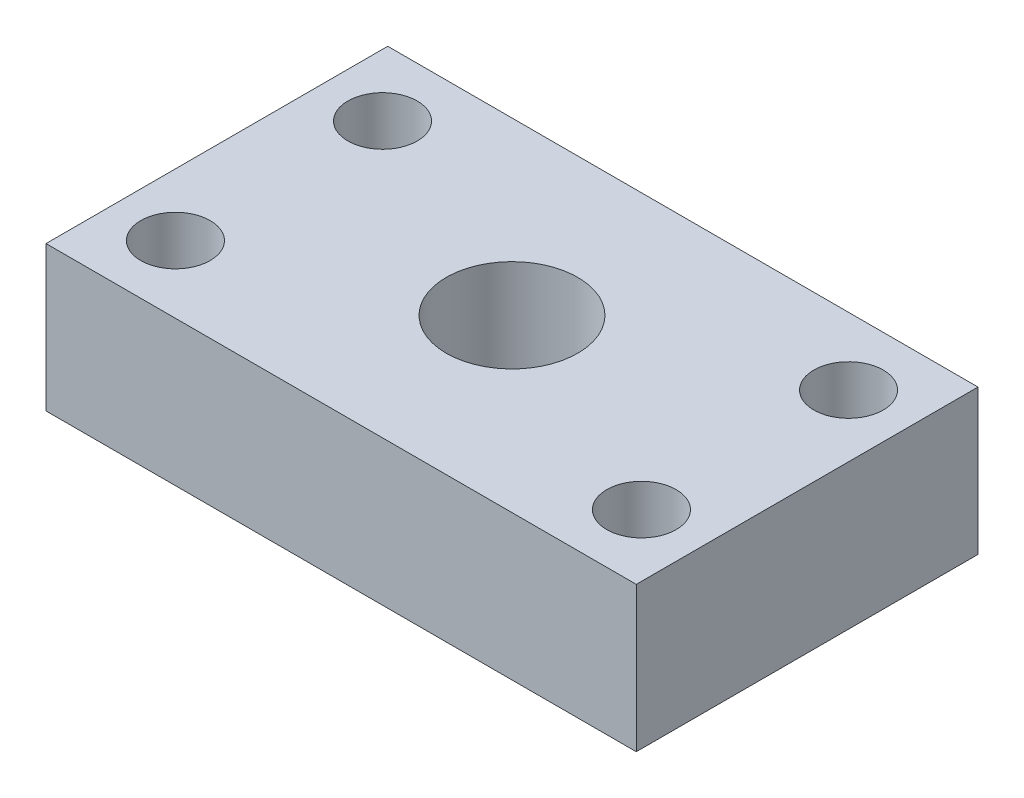
ISO-10303-21;
HEADER;
FILE_DESCRIPTION(('STEP AP214'),'2;1');
FILE_NAME('part.step','',(''),(''),'','','');
FILE_SCHEMA(('AUTOMOTIVE_DESIGN { 1 0 10303 214 1 1 1 1 }'));
ENDSEC;
DATA;
#1=APPLICATION_CONTEXT('core data for automotive mechanical design processes');
#2=APPLICATION_PROTOCOL_DEFINITION('international standard','automotive_design',2000,#1);
#3=PRODUCT_CONTEXT('',#1,'mechanical');
#4=PRODUCT('Part','Part','',(#3));
#5=PRODUCT_RELATED_PRODUCT_CATEGORY('part','',(#4));
#6=PRODUCT_DEFINITION_FORMATION('','',#4);
#7=PRODUCT_DEFINITION_CONTEXT('part definition',#1,'design');
#8=PRODUCT_DEFINITION('design','',#6,#7);
#9=PRODUCT_DEFINITION_SHAPE('','',#8);
#10=(LENGTH_UNIT() NAMED_UNIT(*) SI_UNIT(.MILLI.,.METRE.));
#11=(NAMED_UNIT(*) PLANE_ANGLE_UNIT() SI_UNIT($,.RADIAN.));
#12=(NAMED_UNIT(*) SI_UNIT($,.STERADIAN.) SOLID_ANGLE_UNIT());
#13=UNCERTAINTY_MEASURE_WITH_UNIT(LENGTH_MEASURE(1.E-05),#10,'distance_accuracy_value','');
#14=(GEOMETRIC_REPRESENTATION_CONTEXT(3) GLOBAL_UNCERTAINTY_ASSIGNED_CONTEXT((#13)) GLOBAL_UNIT_ASSIGNED_CONTEXT((#10,
#11,#12)) REPRESENTATION_CONTEXT('',''));
#15=CARTESIAN_POINT('',(0.,0.,0.));
#16=DIRECTION('',(0.,0.,1.));
#17=DIRECTION('',(1.,0.,0.));
#18=AXIS2_PLACEMENT_3D('',#15,#16,#17);
#19=CARTESIAN_POINT('',(0.,14.,0.));
#20=DIRECTION('',(1.,0.,0.));
#21=DIRECTION('',(0.,0.,-1.));
#22=AXIS2_PLACEMENT_3D('',#19,#20,#21);
#23=PLANE('',#22);
#24=DIRECTION('',(0.,0.,1.));
#25=VECTOR('',#24,1.);
#26=CARTESIAN_POINT('',(0.,0.,0.));
#27=LINE('',#26,#25);
#28=CARTESIAN_POINT('',(0.,0.,-33.));
#29=VERTEX_POINT('',#28);
#30=CARTESIAN_POINT('',(0.,0.,0.));
#31=VERTEX_POINT('',#30);
#32=EDGE_CURVE('E128',#29,#31,#27,.T.);
#33=ORIENTED_EDGE('',*,*,#32,.T.);
#34=DIRECTION('',(0.,-1.,0.));
#35=VECTOR('',#34,1.);
#36=CARTESIAN_POINT('',(0.,14.,0.));
#37=LINE('',#36,#35);
#38=CARTESIAN_POINT('',(0.,14.,0.));
#39=VERTEX_POINT('',#38);
#40=EDGE_CURVE('E11',#39,#31,#37,.T.);
#41=ORIENTED_EDGE('',*,*,#40,.F.);
#42=DIRECTION('',(0.,0.,1.));
#43=VECTOR('',#42,1.);
#44=CARTESIAN_POINT('',(0.,14.,0.));
#45=LINE('',#44,#43);
#46=CARTESIAN_POINT('',(0.,14.,-33.));
#47=VERTEX_POINT('',#46);
#48=EDGE_CURVE('E131',#47,#39,#45,.T.);
#49=ORIENTED_EDGE('',*,*,#48,.F.);
#50=DIRECTION('',(0.,-1.,0.));
#51=VECTOR('',#50,1.);
#52=CARTESIAN_POINT('',(0.,14.,-33.));
#53=LINE('',#52,#51);
#54=EDGE_CURVE('E137',#47,#29,#53,.T.);
#55=ORIENTED_EDGE('',*,*,#54,.T.);
#56=EDGE_LOOP('',(#33,#41,#49,#55));
#57=FACE_BOUND('',#56,.T.);
#58=ADVANCED_FACE('F38',(#57),#23,.F.);
#59=CARTESIAN_POINT('',(0.,14.,0.));
#60=DIRECTION('',(0.,0.,-1.));
#61=DIRECTION('',(-1.,0.,0.));
#62=AXIS2_PLACEMENT_3D('',#59,#60,#61);
#63=PLANE('',#62);
#64=DIRECTION('',(1.,0.,0.));
#65=VECTOR('',#64,1.);
#66=CARTESIAN_POINT('',(0.,0.,0.));
#67=LINE('',#66,#65);
#68=CARTESIAN_POINT('',(57.,0.,0.));
#69=VERTEX_POINT('',#68);
#70=EDGE_CURVE('E140',#31,#69,#67,.T.);
#71=ORIENTED_EDGE('',*,*,#70,.T.);
#72=DIRECTION('',(0.,-1.,0.));
#73=VECTOR('',#72,1.);
#74=CARTESIAN_POINT('',(57.,14.,0.));
#75=LINE('',#74,#73);
#76=CARTESIAN_POINT('',(57.,14.,0.));
#77=VERTEX_POINT('',#76);
#78=EDGE_CURVE('E46',#77,#69,#75,.T.);
#79=ORIENTED_EDGE('',*,*,#78,.F.);
#80=DIRECTION('',(1.,0.,0.));
#81=VECTOR('',#80,1.);
#82=CARTESIAN_POINT('',(0.,14.,0.));
#83=LINE('',#82,#81);
#84=EDGE_CURVE('E85',#39,#77,#83,.T.);
#85=ORIENTED_EDGE('',*,*,#84,.F.);
#86=ORIENTED_EDGE('',*,*,#40,.T.);
#87=EDGE_LOOP('',(#71,#79,#85,#86));
#88=FACE_BOUND('',#87,.T.);
#89=ADVANCED_FACE('F165',(#88),#63,.F.);
#90=CARTESIAN_POINT('',(57.,14.,0.));
#91=DIRECTION('',(-1.,0.,0.));
#92=DIRECTION('',(0.,0.,1.));
#93=AXIS2_PLACEMENT_3D('',#90,#91,#92);
#94=PLANE('',#93);
#95=DIRECTION('',(0.,0.,-1.));
#96=VECTOR('',#95,1.);
#97=CARTESIAN_POINT('',(57.,0.,0.));
#98=LINE('',#97,#96);
#99=CARTESIAN_POINT('',(57.,0.,-33.));
#100=VERTEX_POINT('',#99);
#101=EDGE_CURVE('E72',#69,#100,#98,.T.);
#102=ORIENTED_EDGE('',*,*,#101,.T.);
#103=DIRECTION('',(0.,-1.,0.));
#104=VECTOR('',#103,1.);
#105=CARTESIAN_POINT('',(57.,14.,-33.));
#106=LINE('',#105,#104);
#107=CARTESIAN_POINT('',(57.,14.,-33.));
#108=VERTEX_POINT('',#107);
#109=EDGE_CURVE('E145',#108,#100,#106,.T.);
#110=ORIENTED_EDGE('',*,*,#109,.F.);
#111=DIRECTION('',(0.,0.,-1.));
#112=VECTOR('',#111,1.);
#113=CARTESIAN_POINT('',(57.,14.,0.));
#114=LINE('',#113,#112);
#115=EDGE_CURVE('E134',#77,#108,#114,.T.);
#116=ORIENTED_EDGE('',*,*,#115,.F.);
#117=ORIENTED_EDGE('',*,*,#78,.T.);
#118=EDGE_LOOP('',(#102,#110,#116,#117));
#119=FACE_BOUND('',#118,.T.);
#120=ADVANCED_FACE('F147',(#119),#94,.F.);
#121=CARTESIAN_POINT('',(0.,14.,-33.));
#122=DIRECTION('',(0.,0.,1.));
#123=DIRECTION('',(1.,0.,0.));
#124=AXIS2_PLACEMENT_3D('',#121,#122,#123);
#125=PLANE('',#124);
#126=CARTESIAN_POINT('',(28.5,7.,-33.));
#127=DIRECTION('',(0.,0.,-1.));
#128=DIRECTION('',(-1.,0.,0.));
#129=AXIS2_PLACEMENT_3D('',#126,#127,#128);
#130=CIRCLE('',#129,1.72719999999999);
#131=CARTESIAN_POINT('',(26.7728,7.,-33.));
#132=VERTEX_POINT('',#131);
#133=EDGE_CURVE('E100',#132,#132,#130,.T.);
#134=ORIENTED_EDGE('',*,*,#133,.F.);
#135=EDGE_LOOP('',(#134));
#136=FACE_BOUND('',#135,.T.);
#137=DIRECTION('',(-1.,0.,0.));
#138=VECTOR('',#137,1.);
#139=CARTESIAN_POINT('',(0.,0.,-33.));
#140=LINE('',#139,#138);
#141=EDGE_CURVE('E78',#100,#29,#140,.T.);
#142=ORIENTED_EDGE('',*,*,#141,.T.);
#143=ORIENTED_EDGE('',*,*,#54,.F.);
#144=DIRECTION('',(-1.,0.,0.));
#145=VECTOR('',#144,1.);
#146=CARTESIAN_POINT('',(0.,14.,-33.));
#147=LINE('',#146,#145);
#148=EDGE_CURVE('E54',#108,#47,#147,.T.);
#149=ORIENTED_EDGE('',*,*,#148,.F.);
#150=ORIENTED_EDGE('',*,*,#109,.T.);
#151=EDGE_LOOP('',(#142,#143,#149,#150));
#152=FACE_BOUND('',#151,.T.);
#153=ADVANCED_FACE('F154',(#136,#152),#125,.F.);
#154=CARTESIAN_POINT('',(0.,14.,0.));
#155=DIRECTION('',(0.,-1.,0.));
#156=DIRECTION('',(0.,0.,-1.));
#157=AXIS2_PLACEMENT_3D('',#154,#155,#156);
#158=PLANE('',#157);
#159=CARTESIAN_POINT('',(28.5,14.,-16.5));
#160=DIRECTION('',(0.,1.,0.));
#161=DIRECTION('',(0.,0.,1.));
#162=AXIS2_PLACEMENT_3D('',#159,#160,#161);
#163=CIRCLE('',#162,6.34999999999999);
#164=CARTESIAN_POINT('',(28.5,14.,-10.15));
#165=VERTEX_POINT('',#164);
#166=EDGE_CURVE('E273',#165,#165,#163,.T.);
#167=ORIENTED_EDGE('',*,*,#166,.F.);
#168=EDGE_LOOP('',(#167));
#169=FACE_BOUND('',#168,.T.);
#170=CARTESIAN_POINT('',(51.,14.,-6.5));
#171=DIRECTION('',(0.,-1.,0.));
#172=DIRECTION('',(0.,0.,-1.));
#173=AXIS2_PLACEMENT_3D('',#170,#171,#172);
#174=CIRCLE('',#173,3.35000000000001);
#175=CARTESIAN_POINT('',(51.,14.,-9.85000000000001));
#176=VERTEX_POINT('',#175);
#177=EDGE_CURVE('E103',#176,#176,#174,.T.);
#178=ORIENTED_EDGE('',*,*,#177,.T.);
#179=EDGE_LOOP('',(#178));
#180=FACE_BOUND('',#179,.T.);
#181=CARTESIAN_POINT('',(6.00000000000001,14.,-26.5));
#182=DIRECTION('',(0.,-1.,0.));
#183=DIRECTION('',(0.,0.,-1.));
#184=AXIS2_PLACEMENT_3D('',#181,#182,#183);
#185=CIRCLE('',#184,3.35);
#186=CARTESIAN_POINT('',(6.00000000000001,14.,-29.85));
#187=VERTEX_POINT('',#186);
#188=EDGE_CURVE('E113',#187,#187,#185,.T.);
#189=ORIENTED_EDGE('',*,*,#188,.T.);
#190=EDGE_LOOP('',(#189));
#191=FACE_BOUND('',#190,.T.);
#192=CARTESIAN_POINT('',(51.,14.,-26.5));
#193=DIRECTION('',(0.,-1.,0.));
#194=DIRECTION('',(0.,0.,-1.));
#195=AXIS2_PLACEMENT_3D('',#192,#193,#194);
#196=CIRCLE('',#195,3.35000000000001);
#197=CARTESIAN_POINT('',(51.,14.,-29.85));
#198=VERTEX_POINT('',#197);
#199=EDGE_CURVE('E119',#198,#198,#196,.T.);
#200=ORIENTED_EDGE('',*,*,#199,.T.);
#201=EDGE_LOOP('',(#200));
#202=FACE_BOUND('',#201,.T.);
#203=CARTESIAN_POINT('',(6.,14.,-6.5));
#204=DIRECTION('',(0.,-1.,0.));
#205=DIRECTION('',(0.,0.,-1.));
#206=AXIS2_PLACEMENT_3D('',#203,#204,#205);
#207=CIRCLE('',#206,3.35);
#208=CARTESIAN_POINT('',(6.,14.,-9.85));
#209=VERTEX_POINT('',#208);
#210=EDGE_CURVE('E125',#209,#209,#207,.T.);
#211=ORIENTED_EDGE('',*,*,#210,.T.);
#212=EDGE_LOOP('',(#211));
#213=FACE_BOUND('',#212,.T.);
#214=ORIENTED_EDGE('',*,*,#48,.T.);
#215=ORIENTED_EDGE('',*,*,#84,.T.);
#216=ORIENTED_EDGE('',*,*,#115,.T.);
#217=ORIENTED_EDGE('',*,*,#148,.T.);
#218=EDGE_LOOP('',(#214,#215,#216,#217));
#219=FACE_BOUND('',#218,.T.);
#220=ADVANCED_FACE('F156',(#169,#180,#191,#202,#213,#219),#158,.F.);
#221=CARTESIAN_POINT('',(0.,0.,0.));
#222=DIRECTION('',(0.,-1.,0.));
#223=DIRECTION('',(0.,0.,-1.));
#224=AXIS2_PLACEMENT_3D('',#221,#222,#223);
#225=PLANE('',#224);
#226=CARTESIAN_POINT('',(28.5,0.,-16.5));
#227=DIRECTION('',(0.,1.,0.));
#228=DIRECTION('',(0.,0.,1.));
#229=AXIS2_PLACEMENT_3D('',#226,#227,#228);
#230=CIRCLE('',#229,6.34999999999999);
#231=CARTESIAN_POINT('',(28.5,0.,-10.15));
#232=VERTEX_POINT('',#231);
#233=EDGE_CURVE('E106',#232,#232,#230,.T.);
#234=ORIENTED_EDGE('',*,*,#233,.T.);
#235=EDGE_LOOP('',(#234));
#236=FACE_BOUND('',#235,.T.);
#237=CARTESIAN_POINT('',(51.,0.,-6.5));
#238=DIRECTION('',(0.,-1.,0.));
#239=DIRECTION('',(0.,0.,-1.));
#240=AXIS2_PLACEMENT_3D('',#237,#238,#239);
#241=CIRCLE('',#240,3.35000000000001);
#242=CARTESIAN_POINT('',(51.,0.,-9.85000000000001));
#243=VERTEX_POINT('',#242);
#244=EDGE_CURVE('E99',#243,#243,#241,.T.);
#245=ORIENTED_EDGE('',*,*,#244,.F.);
#246=EDGE_LOOP('',(#245));
#247=FACE_BOUND('',#246,.T.);
#248=CARTESIAN_POINT('',(6.00000000000001,0.,-26.5));
#249=DIRECTION('',(0.,-1.,0.));
#250=DIRECTION('',(0.,0.,-1.));
#251=AXIS2_PLACEMENT_3D('',#248,#249,#250);
#252=CIRCLE('',#251,3.35);
#253=CARTESIAN_POINT('',(6.00000000000001,0.,-29.85));
#254=VERTEX_POINT('',#253);
#255=EDGE_CURVE('E111',#254,#254,#252,.T.);
#256=ORIENTED_EDGE('',*,*,#255,.F.);
#257=EDGE_LOOP('',(#256));
#258=FACE_BOUND('',#257,.T.);
#259=CARTESIAN_POINT('',(51.,0.,-26.5));
#260=DIRECTION('',(0.,-1.,0.));
#261=DIRECTION('',(0.,0.,-1.));
#262=AXIS2_PLACEMENT_3D('',#259,#260,#261);
#263=CIRCLE('',#262,3.35000000000001);
#264=CARTESIAN_POINT('',(51.,0.,-29.85));
#265=VERTEX_POINT('',#264);
#266=EDGE_CURVE('E116',#265,#265,#263,.T.);
#267=ORIENTED_EDGE('',*,*,#266,.F.);
#268=EDGE_LOOP('',(#267));
#269=FACE_BOUND('',#268,.T.);
#270=CARTESIAN_POINT('',(6.,0.,-6.5));
#271=DIRECTION('',(0.,-1.,0.));
#272=DIRECTION('',(0.,0.,-1.));
#273=AXIS2_PLACEMENT_3D('',#270,#271,#272);
#274=CIRCLE('',#273,3.35);
#275=CARTESIAN_POINT('',(6.,0.,-9.85));
#276=VERTEX_POINT('',#275);
#277=EDGE_CURVE('E122',#276,#276,#274,.T.);
#278=ORIENTED_EDGE('',*,*,#277,.F.);
#279=EDGE_LOOP('',(#278));
#280=FACE_BOUND('',#279,.T.);
#281=ORIENTED_EDGE('',*,*,#32,.F.);
#282=ORIENTED_EDGE('',*,*,#141,.F.);
#283=ORIENTED_EDGE('',*,*,#101,.F.);
#284=ORIENTED_EDGE('',*,*,#70,.F.);
#285=EDGE_LOOP('',(#281,#282,#283,#284));
#286=FACE_BOUND('',#285,.T.);
#287=ADVANCED_FACE('F150',(#236,#247,#258,#269,#280,#286),#225,.T.);
#288=CARTESIAN_POINT('',(6.,14.,-6.5));
#289=DIRECTION('',(0.,-1.,0.));
#290=DIRECTION('',(0.,0.,-1.));
#291=AXIS2_PLACEMENT_3D('',#288,#289,#290);
#292=CYLINDRICAL_SURFACE('',#291,3.35);
#293=ORIENTED_EDGE('',*,*,#210,.F.);
#294=EDGE_LOOP('',(#293));
#295=FACE_BOUND('',#294,.T.);
#296=ORIENTED_EDGE('',*,*,#277,.T.);
#297=EDGE_LOOP('',(#296));
#298=FACE_BOUND('',#297,.T.);
#299=ADVANCED_FACE('F185',(#295,#298),#292,.F.);
#300=CARTESIAN_POINT('',(51.,14.,-26.5));
#301=DIRECTION('',(0.,-1.,0.));
#302=DIRECTION('',(0.,0.,-1.));
#303=AXIS2_PLACEMENT_3D('',#300,#301,#302);
#304=CYLINDRICAL_SURFACE('',#303,3.35000000000001);
#305=ORIENTED_EDGE('',*,*,#199,.F.);
#306=EDGE_LOOP('',(#305));
#307=FACE_BOUND('',#306,.T.);
#308=ORIENTED_EDGE('',*,*,#266,.T.);
#309=EDGE_LOOP('',(#308));
#310=FACE_BOUND('',#309,.T.);
#311=ADVANCED_FACE('F190',(#307,#310),#304,.F.);
#312=CARTESIAN_POINT('',(6.00000000000001,14.,-26.5));
#313=DIRECTION('',(0.,-1.,0.));
#314=DIRECTION('',(0.,0.,-1.));
#315=AXIS2_PLACEMENT_3D('',#312,#313,#314);
#316=CYLINDRICAL_SURFACE('',#315,3.35);
#317=ORIENTED_EDGE('',*,*,#188,.F.);
#318=EDGE_LOOP('',(#317));
#319=FACE_BOUND('',#318,.T.);
#320=ORIENTED_EDGE('',*,*,#255,.T.);
#321=EDGE_LOOP('',(#320));
#322=FACE_BOUND('',#321,.T.);
#323=ADVANCED_FACE('F202',(#319,#322),#316,.F.);
#324=CARTESIAN_POINT('',(51.,14.,-6.5));
#325=DIRECTION('',(0.,-1.,0.));
#326=DIRECTION('',(0.,0.,-1.));
#327=AXIS2_PLACEMENT_3D('',#324,#325,#326);
#328=CYLINDRICAL_SURFACE('',#327,3.35000000000001);
#329=ORIENTED_EDGE('',*,*,#177,.F.);
#330=EDGE_LOOP('',(#329));
#331=FACE_BOUND('',#330,.T.);
#332=ORIENTED_EDGE('',*,*,#244,.T.);
#333=EDGE_LOOP('',(#332));
#334=FACE_BOUND('',#333,.T.);
#335=ADVANCED_FACE('F93',(#331,#334),#328,.F.);
#336=CARTESIAN_POINT('',(28.5,7.,-28.));
#337=DIRECTION('',(0.,0.,-1.));
#338=DIRECTION('',(-1.,0.,0.));
#339=AXIS2_PLACEMENT_3D('',#336,#337,#338);
#340=CONICAL_SURFACE('',#339,1.7272,1.02974425867665);
#341=CARTESIAN_POINT('',(28.5,7.,-26.9621935388156));
#342=VERTEX_POINT('',#341);
#343=VERTEX_LOOP('',#342);
#344=FACE_BOUND('',#343,.T.);
#345=CARTESIAN_POINT('',(28.5,7.,-28.));
#346=DIRECTION('',(0.,0.,-1.));
#347=DIRECTION('',(-1.,0.,0.));
#348=AXIS2_PLACEMENT_3D('',#345,#346,#347);
#349=CIRCLE('',#348,1.7272);
#350=CARTESIAN_POINT('',(26.7728,7.,-28.));
#351=VERTEX_POINT('',#350);
#352=EDGE_CURVE('E97',#351,#351,#349,.T.);
#353=ORIENTED_EDGE('',*,*,#352,.T.);
#354=EDGE_LOOP('',(#353));
#355=FACE_BOUND('',#354,.T.);
#356=ADVANCED_FACE('F89',(#344,#355),#340,.F.);
#357=CARTESIAN_POINT('',(28.5,7.,-33.));
#358=DIRECTION('',(0.,0.,-1.));
#359=DIRECTION('',(-1.,0.,0.));
#360=AXIS2_PLACEMENT_3D('',#357,#358,#359);
#361=CYLINDRICAL_SURFACE('',#360,1.72719999999999);
#362=ORIENTED_EDGE('',*,*,#352,.F.);
#363=EDGE_LOOP('',(#362));
#364=FACE_BOUND('',#363,.T.);
#365=ORIENTED_EDGE('',*,*,#133,.T.);
#366=EDGE_LOOP('',(#365));
#367=FACE_BOUND('',#366,.T.);
#368=ADVANCED_FACE('F92',(#364,#367),#361,.F.);
#369=CARTESIAN_POINT('',(28.5,14.,-16.5));
#370=DIRECTION('',(0.,1.,0.));
#371=DIRECTION('',(0.,0.,1.));
#372=AXIS2_PLACEMENT_3D('',#369,#370,#371);
#373=CYLINDRICAL_SURFACE('',#372,6.34999999999999);
#374=ORIENTED_EDGE('',*,*,#233,.F.);
#375=EDGE_LOOP('',(#374));
#376=FACE_BOUND('',#375,.T.);
#377=ORIENTED_EDGE('',*,*,#166,.T.);
#378=EDGE_LOOP('',(#377));
#379=FACE_BOUND('',#378,.T.);
#380=ADVANCED_FACE('F241',(#376,#379),#373,.F.);
#381=CLOSED_SHELL('',(#58,#89,#120,#153,#220,#287,#299,#311,#323,#335,#356,#368,#380));
#382=MANIFOLD_SOLID_BREP('B2',#381);
#383=ADVANCED_BREP_SHAPE_REPRESENTATION('',(#18,#382),#14);
#384=SHAPE_DEFINITION_REPRESENTATION(#9,#383);
ENDSEC;
END-ISO-10303-21;
